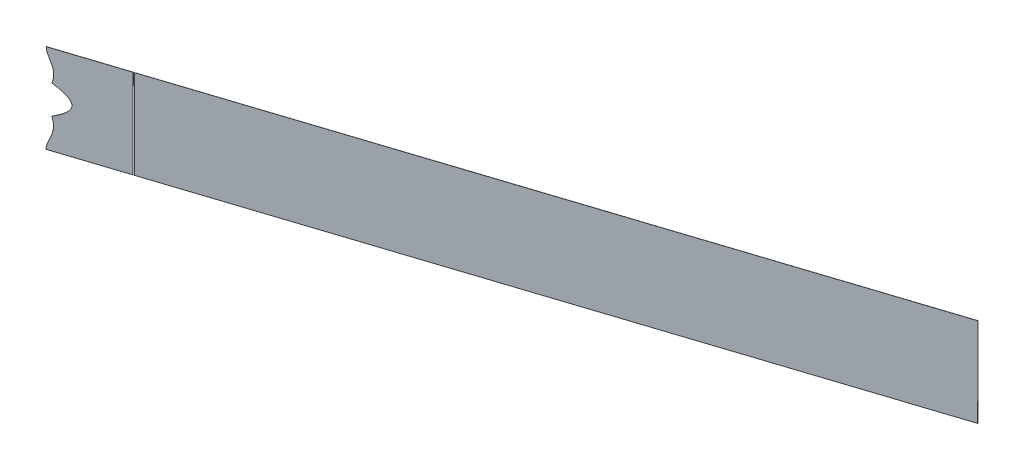
ISO-10303-21;
HEADER;
FILE_DESCRIPTION(('STEP AP214'),'2;1');
FILE_NAME('part.step','',(''),(''),'','','');
FILE_SCHEMA(('AUTOMOTIVE_DESIGN { 1 0 10303 214 1 1 1 1 }'));
ENDSEC;
DATA;
#1=APPLICATION_CONTEXT('core data for automotive mechanical design processes');
#2=APPLICATION_PROTOCOL_DEFINITION('international standard','automotive_design',2000,#1);
#3=PRODUCT_CONTEXT('',#1,'mechanical');
#4=PRODUCT('Part','Part','',(#3));
#5=PRODUCT_RELATED_PRODUCT_CATEGORY('part','',(#4));
#6=PRODUCT_DEFINITION_FORMATION('','',#4);
#7=PRODUCT_DEFINITION_CONTEXT('part definition',#1,'design');
#8=PRODUCT_DEFINITION('design','',#6,#7);
#9=PRODUCT_DEFINITION_SHAPE('','',#8);
#10=(LENGTH_UNIT() NAMED_UNIT(*) SI_UNIT(.MILLI.,.METRE.));
#11=(NAMED_UNIT(*) PLANE_ANGLE_UNIT() SI_UNIT($,.RADIAN.));
#12=(NAMED_UNIT(*) SI_UNIT($,.STERADIAN.) SOLID_ANGLE_UNIT());
#13=UNCERTAINTY_MEASURE_WITH_UNIT(LENGTH_MEASURE(1.E-05),#10,'distance_accuracy_value','');
#14=(GEOMETRIC_REPRESENTATION_CONTEXT(3) GLOBAL_UNCERTAINTY_ASSIGNED_CONTEXT((#13)) GLOBAL_UNIT_ASSIGNED_CONTEXT((#10,
#11,#12)) REPRESENTATION_CONTEXT('',''));
#15=CARTESIAN_POINT('',(0.,0.,0.));
#16=DIRECTION('',(0.,0.,1.));
#17=DIRECTION('',(1.,0.,0.));
#18=AXIS2_PLACEMENT_3D('',#15,#16,#17);
#19=CARTESIAN_POINT('',(7.6941798251794,-0.0503968253968697,-15.8534556793714));
#20=DIRECTION('',(0.00122625791418758,-0.999992126449225,0.00377403379482593));
#21=DIRECTION('',(0.,-0.00377403663235242,-0.999992878298389));
#22=AXIS2_PLACEMENT_3D('',#19,#20,#21);
#23=PLANE('',#22);
#24=DIRECTION('',(-0.309014561313953,-0.00396825396825808,-0.951049028103383));
#25=VECTOR('',#24,1.);
#26=CARTESIAN_POINT('',(69.5438428902936,-0.0107142857133384,-25.4350899596255));
#27=LINE('',#26,#25);
#28=CARTESIAN_POINT('',(66.4845987332853,-0.0499999999985215,-34.8504753378487));
#29=VERTEX_POINT('',#28);
#30=CARTESIAN_POINT('',(66.453697277154,-0.0503968253959192,-34.9455802406593));
#31=VERTEX_POINT('',#30);
#32=EDGE_CURVE('E130',#29,#31,#27,.T.);
#33=ORIENTED_EDGE('',*,*,#32,.T.);
#34=DIRECTION('',(0.951056516295153,0.,-0.309016994374949));
#35=VECTOR('',#34,1.);
#36=CARTESIAN_POINT('',(7.6941798251794,-0.0503968253968697,-15.8534556793714));
#37=LINE('',#36,#35);
#38=CARTESIAN_POINT('',(7.69417982517977,-0.0503968253958211,-15.8534556793713));
#39=VERTEX_POINT('',#38);
#40=EDGE_CURVE('E153',#39,#31,#37,.T.);
#41=ORIENTED_EDGE('',*,*,#40,.F.);
#42=DIRECTION('',(0.309014561313953,0.00396825396825806,0.951049028103383));
#43=VECTOR('',#42,1.);
#44=CARTESIAN_POINT('',(7.69417982517977,-0.0503968253958211,-15.8534556793713));
#45=LINE('',#44,#43);
#46=CARTESIAN_POINT('',(7.72508128131116,-0.0499999999989953,-15.758350776561));
#47=VERTEX_POINT('',#46);
#48=EDGE_CURVE('E140',#39,#47,#45,.T.);
#49=ORIENTED_EDGE('',*,*,#48,.T.);
#50=DIRECTION('',(0.951056516295153,0.,-0.309016994374949));
#51=VECTOR('',#50,1.);
#52=CARTESIAN_POINT('',(7.72508128131079,-0.0500000000000439,-15.758350776561));
#53=LINE('',#52,#51);
#54=EDGE_CURVE('E60',#47,#29,#53,.T.);
#55=ORIENTED_EDGE('',*,*,#54,.T.);
#56=EDGE_LOOP('',(#33,#41,#49,#55));
#57=FACE_BOUND('',#56,.T.);
#58=ADVANCED_FACE('F57',(#57),#23,.F.);
#59=CARTESIAN_POINT('',(7.79152250467645,-79.4316688549309,-15.5538657172189));
#60=DIRECTION('',(0.00122625791418755,-0.999992126449225,0.00377403379482594));
#61=DIRECTION('',(0.,-0.00377403663235243,-0.999992878298389));
#62=AXIS2_PLACEMENT_3D('',#59,#60,#61);
#63=PLANE('',#62);
#64=DIRECTION('',(0.951056516295153,0.,-0.309016994374949));
#65=VECTOR('',#64,1.);
#66=CARTESIAN_POINT('',(7.79152250467645,-79.4316688549309,-15.5538657172189));
#67=LINE('',#66,#65);
#68=CARTESIAN_POINT('',(7.79152250467594,-79.4316688549309,-15.5538657172187));
#69=VERTEX_POINT('',#68);
#70=CARTESIAN_POINT('',(67.5020964729461,-79.4316688549309,-34.9550072728817));
#71=VERTEX_POINT('',#70);
#72=EDGE_CURVE('E146',#69,#71,#67,.T.);
#73=ORIENTED_EDGE('',*,*,#72,.T.);
#74=DIRECTION('',(-0.309014561313953,-0.00396825396825808,-0.951049028103383));
#75=VECTOR('',#74,1.);
#76=CARTESIAN_POINT('',(70.5922420860856,-79.3919863152484,-25.4445169918479));
#77=LINE('',#76,#75);
#78=CARTESIAN_POINT('',(67.5329979290771,-79.4312720295352,-34.8599023700708));
#79=VERTEX_POINT('',#78);
#80=EDGE_CURVE('E66',#79,#71,#77,.T.);
#81=ORIENTED_EDGE('',*,*,#80,.F.);
#82=DIRECTION('',(0.951056516295153,0.,-0.309016994374949));
#83=VECTOR('',#82,1.);
#84=CARTESIAN_POINT('',(7.82242396080784,-79.4312720295341,-15.4587608144085));
#85=LINE('',#84,#83);
#86=CARTESIAN_POINT('',(7.82242396080733,-79.4312720295341,-15.4587608144084));
#87=VERTEX_POINT('',#86);
#88=EDGE_CURVE('E177',#87,#79,#85,.T.);
#89=ORIENTED_EDGE('',*,*,#88,.F.);
#90=DIRECTION('',(0.309014561313953,0.00396825396825806,0.951049028103383));
#91=VECTOR('',#90,1.);
#92=CARTESIAN_POINT('',(7.79152250467594,-79.4316688549309,-15.5538657172187));
#93=LINE('',#92,#91);
#94=EDGE_CURVE('E124',#69,#87,#93,.T.);
#95=ORIENTED_EDGE('',*,*,#94,.F.);
#96=EDGE_LOOP('',(#73,#81,#89,#95));
#97=FACE_BOUND('',#96,.T.);
#98=ADVANCED_FACE('F209',(#97),#63,.T.);
#99=CARTESIAN_POINT('',(-6335.94392116711,6657.43831861357,2017.54112415161));
#100=DIRECTION('',(-0.309014561313953,-0.00396825396825808,-0.951049028103383));
#101=DIRECTION('',(-0.951056516295153,0.,0.309016994374949));
#102=AXIS2_PLACEMENT_3D('',#99,#100,#101);
#103=PLANE('',#102);
#104=DIRECTION('',(-0.00122625791418582,0.999992126449225,-0.00377403379482654));
#105=VECTOR('',#104,1.);
#106=CARTESIAN_POINT('',(66.453697277154,-0.0503968253959192,-34.9455802406593));
#107=LINE('',#106,#105);
#108=CARTESIAN_POINT('',(66.5510383755583,-79.4303795012089,-34.6459951446096));
#109=VERTEX_POINT('',#108);
#110=EDGE_CURVE('E136',#109,#31,#107,.T.);
#111=ORIENTED_EDGE('',*,*,#110,.F.);
#112=DIRECTION('',(-0.951057306841153,0.00128935265031942,0.309011871412404));
#113=VECTOR('',#112,1.);
#114=CARTESIAN_POINT('',(66.5510383755583,-79.4303795012089,-34.6459951446096));
#115=LINE('',#114,#113);
#116=EDGE_CURVE('E14',#71,#109,#115,.T.);
#117=ORIENTED_EDGE('',*,*,#116,.F.);
#118=ORIENTED_EDGE('',*,*,#72,.F.);
#119=CARTESIAN_POINT('',(11.5973214751107,-52.6116321989723,-16.9023514191011));
#120=CARTESIAN_POINT('',(11.880021332476,-53.4693765115704,-16.9906272310246));
#121=CARTESIAN_POINT('',(12.3243048156577,-55.1299482507111,-17.1280549465251));
#122=CARTESIAN_POINT('',(12.6475799589412,-56.8227473349635,-17.2260302003221));
#123=CARTESIAN_POINT('',(12.8269288148534,-58.5339875185176,-17.277164023023));
#124=CARTESIAN_POINT('',(12.8492882312764,-60.2619705361145,-17.2772190252246));
#125=CARTESIAN_POINT('',(12.7109829764599,-61.9859245519917,-17.2250877222697));
#126=CARTESIAN_POINT('',(12.423970013855,-63.6895247155585,-17.1247232825621));
#127=CARTESIAN_POINT('',(12.0088982888613,-65.3631922901153,-16.9828749224666));
#128=CARTESIAN_POINT('',(11.4958537352224,-66.9973463961545,-16.8093581306745));
#129=CARTESIAN_POINT('',(11.1797349524949,-67.867247410739,-16.7030152480975));
#130=CARTESIAN_POINT('',(10.9220750444957,-68.5762803048092,-16.6163380278931));
#131=CARTESIAN_POINT('',(10.5678075102795,-69.4783752320334,-16.4974655354055));
#132=CARTESIAN_POINT('',(10.435233775274,-69.8159565294401,-16.4529811590621));
#133=CARTESIAN_POINT('',(10.0885816634332,-70.6848530724343,-16.336721587624));
#134=CARTESIAN_POINT('',(9.55384249698816,-72.0216046060618,-16.1573967016564));
#135=CARTESIAN_POINT('',(9.30159778580686,-72.6877992792752,-16.0726577281188));
#136=CARTESIAN_POINT('',(8.96361182755066,-73.5804421575115,-15.9591148790399));
#137=CARTESIAN_POINT('',(8.72405442673306,-74.3095605237517,-15.8782357132975));
#138=CARTESIAN_POINT('',(8.43313668982986,-75.1949995221584,-15.7800163146055));
#139=CARTESIAN_POINT('',(8.24021613139369,-75.9790331922441,-15.7140612433081));
#140=CARTESIAN_POINT('',(8.02346052320405,-76.8599330630482,-15.6399575204688));
#141=CARTESIAN_POINT('',(7.79381394927447,-78.5672427210742,-15.5582170724704));
#142=CARTESIAN_POINT('',(7.7915225046759,-79.4316688549322,-15.5538657172188));
#143=B_SPLINE_CURVE_WITH_KNOTS('',2,(#119,#120,#121,#122,#123,#124,#125,#126,#127,#128,#129,
#130,#131,#132,#133,#134,#135,#136,#137,#138,#139,#140,#141,#142),.UNSPECIFIED.,.F.,.F.,(3,1,1,
1,1,1,1,1,1,2,2,1,1,2,2,2,1,3),(0.,0.0625,0.125,0.1875,0.25,0.3125,0.375,0.4375,0.5,0.5625,
0.625,0.65625,0.6875,0.75,0.8125,0.875,0.9375,1.),.UNSPECIFIED.);
#144=CARTESIAN_POINT('',(11.5973216322441,-52.6116326757335,-16.9023514681676));
#145=VERTEX_POINT('',#144);
#146=EDGE_CURVE('E161',#145,#69,#143,.T.);
#147=ORIENTED_EDGE('',*,*,#146,.F.);
#148=CARTESIAN_POINT('',(11.5973214751107,-52.6116321989723,-16.9023514191011));
#149=CARTESIAN_POINT('',(13.823357893079,-51.4479684200354,-17.6304898852711));
#150=CARTESIAN_POINT('',(15.6982156234339,-50.3369915319264,-18.2443036427817));
#151=CARTESIAN_POINT('',(15.9063746580735,-50.2126749028105,-18.3124573244681));
#152=CARTESIAN_POINT('',(18.0805012906737,-48.9013379898872,-19.0243454453913));
#153=CARTESIAN_POINT('',(19.7272138162503,-47.6726723592705,-19.5645213887811));
#154=CARTESIAN_POINT('',(20.8454406273334,-46.8270584609381,-19.9313836302364));
#155=CARTESIAN_POINT('',(21.6762478592349,-46.0636665740444,-20.204514517826));
#156=CARTESIAN_POINT('',(22.6602060613233,-45.1595510588255,-20.5279943417463));
#157=CARTESIAN_POINT('',(23.3646889076603,-44.2755409513914,-20.7605832281176));
#158=CARTESIAN_POINT('',(24.2107173726805,-43.2139143722037,-21.0399041789971));
#159=CARTESIAN_POINT('',(24.663029587717,-42.1693456652739,-21.1912277915241));
#160=CARTESIAN_POINT('',(25.1953779153317,-40.939941758577,-21.3693279386775));
#161=CARTESIAN_POINT('',(25.182419340284,-38.5023625911408,-21.3752882463513));
#162=CARTESIAN_POINT('',(24.6420537314844,-37.2784652851526,-21.2048195308382));
#163=CARTESIAN_POINT('',(24.1819340320198,-36.2363203902184,-21.0596659295118));
#164=CARTESIAN_POINT('',(23.3299168693448,-35.177029154345,-20.787248666626));
#165=CARTESIAN_POINT('',(22.6229123550666,-34.298028450482,-20.5611966068033));
#166=CARTESIAN_POINT('',(21.6396013345,-33.3990451136564,-20.2454504984658));
#167=CARTESIAN_POINT('',(20.8075741619763,-32.6383716865924,-19.9782823937046));
#168=CARTESIAN_POINT('',(19.685110325139,-31.7924040198094,-19.6171015865857));
#169=CARTESIAN_POINT('',(18.0288437254508,-30.5615300324931,-19.0840837703031));
#170=CARTESIAN_POINT('',(15.8560097079869,-29.2546240284676,-18.383540269295));
#171=CARTESIAN_POINT('',(15.6537087525518,-29.1340776329297,-18.3183116843834));
#172=CARTESIAN_POINT('',(13.7835050062533,-28.0282806307363,-17.7152595914413));
#173=CARTESIAN_POINT('',(11.5657558779292,-26.8704334813566,-16.9995003378877));
#174=B_SPLINE_CURVE_WITH_KNOTS('',2,(#148,#149,#150,#151,#152,#153,#154,#155,#156,#157,#158,
#159,#160,#161,#162,#163,#164,#165,#166,#167,#168,#169,#170,#171,#172,#173),.UNSPECIFIED.,.F.,
.F.,(3,1,1,1,1,1,2,2,2,1,2,2,2,1,1,1,1,1,3),(0.,0.11875,0.125,0.13125,0.2440625,0.25,0.3125,
0.375,0.4375,0.5,0.5625,0.625,0.6875,0.75,0.75625,0.8690625,0.875,0.88125,1.),.UNSPECIFIED.);
#175=CARTESIAN_POINT('',(11.5657560339004,-26.870433004574,-16.9995003905552));
#176=VERTEX_POINT('',#175);
#177=EDGE_CURVE('E117',#145,#176,#174,.T.);
#178=ORIENTED_EDGE('',*,*,#177,.T.);
#179=CARTESIAN_POINT('',(7.69417982517977,-0.0503968253958211,-15.8534556793713));
#180=CARTESIAN_POINT('',(7.69854311683604,-0.905380477290335,-15.8513059777769));
#181=CARTESIAN_POINT('',(7.92847013452326,-2.60158233546576,-15.9189363888804));
#182=CARTESIAN_POINT('',(8.33946287656427,-4.26403874808862,-16.0455394230774));
#183=CARTESIAN_POINT('',(8.63104110127546,-5.14759564777318,-16.1365922883515));
#184=CARTESIAN_POINT('',(8.87281053984268,-5.88021913428111,-16.2120910679292));
#185=CARTESIAN_POINT('',(9.21403508960307,-6.77651982862343,-16.3192218285481));
#186=CARTESIAN_POINT('',(9.35453534292416,-7.14557438432745,-16.3633332473076));
#187=CARTESIAN_POINT('',(9.52813304948989,-7.5854750719871,-16.4179030748939));
#188=CARTESIAN_POINT('',(9.65946875767712,-7.91828285781399,-16.4591879921522));
#189=CARTESIAN_POINT('',(10.0079060540432,-8.78640774899193,-16.5687798798022));
#190=CARTESIAN_POINT('',(10.3281909622022,-9.58208906962483,-16.6695267729706));
#191=CARTESIAN_POINT('',(10.8468357620076,-10.8939022909829,-16.8325711404909));
#192=CARTESIAN_POINT('',(11.1071562906736,-11.6049864813912,-16.9141874073848));
#193=CARTESIAN_POINT('',(11.4219950678193,-12.4649911767654,-17.0128963559091));
#194=CARTESIAN_POINT('',(11.9360898296159,-14.0847347426079,-17.1731774864848));
#195=CARTESIAN_POINT('',(12.3568307233138,-15.7530921240839,-17.3029232653534));
#196=CARTESIAN_POINT('',(12.6513443977263,-17.4567314475243,-17.3915081205022));
#197=CARTESIAN_POINT('',(12.7976764389193,-19.1828630827805,-17.4318519951818));
#198=CARTESIAN_POINT('',(12.7827767163835,-20.9149364850705,-17.4197837021329));
#199=CARTESIAN_POINT('',(12.609349284114,-22.6369560435578,-17.3562485834761));
#200=CARTESIAN_POINT('',(12.2898505262247,-24.3374017957117,-17.2453420308206));
#201=CARTESIAN_POINT('',(11.8492878286753,-26.0037150078596,-17.0952418377573));
#202=CARTESIAN_POINT('',(11.5657558779292,-26.8704334813566,-16.9995003378877));
#203=B_SPLINE_CURVE_WITH_KNOTS('',2,(#179,#180,#181,#182,#183,#184,#185,#186,#187,#188,#189,
#190,#191,#192,#193,#194,#195,#196,#197,#198,#199,#200,#201,#202),.UNSPECIFIED.,.F.,.F.,(3,1,1,
2,2,2,1,1,1,2,1,1,1,1,1,1,1,1,3),(0.,0.0625,0.125,0.1875,0.25,0.28125,0.3125,0.34375,0.375,
0.4375,0.5,0.5625,0.625,0.6875,0.75,0.8125,0.875,0.9375,1.),.UNSPECIFIED.);
#204=EDGE_CURVE('E157',#39,#176,#203,.T.);
#205=ORIENTED_EDGE('',*,*,#204,.F.);
#206=ORIENTED_EDGE('',*,*,#40,.T.);
#207=EDGE_LOOP('',(#111,#117,#118,#147,#178,#205,#206));
#208=FACE_BOUND('',#207,.T.);
#209=ADVANCED_FACE('F207',(#208),#103,.T.);
#210=CARTESIAN_POINT('',(-6335.91301971098,6657.43871543897,2017.63622905442));
#211=DIRECTION('',(-0.309014561313953,-0.00396825396825808,-0.951049028103383));
#212=DIRECTION('',(-0.951056516295153,0.,0.309016994374949));
#213=AXIS2_PLACEMENT_3D('',#210,#211,#212);
#214=PLANE('',#213);
#215=DIRECTION('',(-0.951057306841152,0.00128935265031943,0.309011871412407));
#216=VECTOR('',#215,1.);
#217=CARTESIAN_POINT('',(-6335.91301971096,-70.7500915847463,2045.70961028262));
#218=LINE('',#217,#216);
#219=CARTESIAN_POINT('',(66.58193983169,-79.4299826758119,-34.5508902417986));
#220=VERTEX_POINT('',#219);
#221=EDGE_CURVE('E75',#79,#220,#218,.T.);
#222=ORIENTED_EDGE('',*,*,#221,.T.);
#223=DIRECTION('',(-0.00122625791418582,0.999992126449225,-0.00377403379482652));
#224=VECTOR('',#223,1.);
#225=CARTESIAN_POINT('',(58.3207362287901,6657.43871543895,-59.9762605677374));
#226=LINE('',#225,#224);
#227=EDGE_CURVE('E134',#220,#29,#226,.T.);
#228=ORIENTED_EDGE('',*,*,#227,.T.);
#229=ORIENTED_EDGE('',*,*,#54,.F.);
#230=CARTESIAN_POINT('',(7.72508128131116,-0.0499999999989953,-15.758350776561));
#231=CARTESIAN_POINT('',(7.72944457296743,-0.904983651893509,-15.7562010749666));
#232=CARTESIAN_POINT('',(7.95937159065465,-2.60118551006894,-15.82383148607));
#233=CARTESIAN_POINT('',(8.37036433269567,-4.2636419226918,-15.9504345202671));
#234=CARTESIAN_POINT('',(8.66194255740686,-5.14719882237635,-16.0414873855411));
#235=CARTESIAN_POINT('',(8.90371199597408,-5.87982230888429,-16.1169861651189));
#236=CARTESIAN_POINT('',(9.24493654573447,-6.77612300322661,-16.2241169257378));
#237=CARTESIAN_POINT('',(9.38543679905556,-7.14517755893063,-16.2682283444973));
#238=CARTESIAN_POINT('',(9.55903450562129,-7.58507824659027,-16.3227981720836));
#239=CARTESIAN_POINT('',(9.69037021380852,-7.91788603241717,-16.3640830893419));
#240=CARTESIAN_POINT('',(10.0388075101746,-8.7860109235951,-16.4736749769919));
#241=CARTESIAN_POINT('',(10.3590924183336,-9.581692244228,-16.5744218701603));
#242=CARTESIAN_POINT('',(10.877737218139,-10.8935054655861,-16.7374662376805));
#243=CARTESIAN_POINT('',(11.1380577468049,-11.6045896559944,-16.8190825045745));
#244=CARTESIAN_POINT('',(11.4528965239507,-12.4645943513686,-16.9177914530987));
#245=CARTESIAN_POINT('',(11.9669912857473,-14.0843379172111,-17.0780725836745));
#246=CARTESIAN_POINT('',(12.3877321794452,-15.7526952986871,-17.2078183625431));
#247=CARTESIAN_POINT('',(12.6822458538577,-17.4563346221275,-17.2964032176918));
#248=CARTESIAN_POINT('',(12.8285778950507,-19.1824662573836,-17.3367470923715));
#249=CARTESIAN_POINT('',(12.8136781725149,-20.9145396596737,-17.3246787993226));
#250=CARTESIAN_POINT('',(12.6402507402454,-22.636559218161,-17.2611436806658));
#251=CARTESIAN_POINT('',(12.3207519823561,-24.3370049703149,-17.1502371280103));
#252=CARTESIAN_POINT('',(11.8801892848067,-26.0033181824628,-17.000136934947));
#253=CARTESIAN_POINT('',(11.5966573340606,-26.8700366559598,-16.9043954350773));
#254=B_SPLINE_CURVE_WITH_KNOTS('',2,(#230,#231,#232,#233,#234,#235,#236,#237,#238,#239,#240,
#241,#242,#243,#244,#245,#246,#247,#248,#249,#250,#251,#252,#253),.UNSPECIFIED.,.F.,.F.,(3,1,1,
2,2,2,1,1,1,2,1,1,1,1,1,1,1,1,3),(0.,0.0625,0.125,0.1875,0.25,0.28125,0.3125,0.34375,0.375,
0.4375,0.5,0.5625,0.625,0.6875,0.75,0.8125,0.875,0.9375,1.),.UNSPECIFIED.);
#255=CARTESIAN_POINT('',(11.5966574900318,-26.8700361791772,-16.9043954877448));
#256=VERTEX_POINT('',#255);
#257=EDGE_CURVE('E149',#47,#256,#254,.T.);
#258=ORIENTED_EDGE('',*,*,#257,.T.);
#259=CARTESIAN_POINT('',(11.6282229312421,-52.6112353735755,-16.8072465162908));
#260=CARTESIAN_POINT('',(13.8542593492104,-51.4475715946386,-17.5353849824608));
#261=CARTESIAN_POINT('',(15.7291170795653,-50.3365947065296,-18.1491987399714));
#262=CARTESIAN_POINT('',(15.9372761142049,-50.2122780774136,-18.2173524216578));
#263=CARTESIAN_POINT('',(18.1114027468051,-48.9009411644904,-18.9292405425809));
#264=CARTESIAN_POINT('',(19.7581152723817,-47.6722755338737,-19.4694164859708));
#265=CARTESIAN_POINT('',(20.8763420834648,-46.8266616355413,-19.8362787274261));
#266=CARTESIAN_POINT('',(21.7071493153662,-46.0632697486476,-20.1094096150156));
#267=CARTESIAN_POINT('',(22.6911075174547,-45.1591542334286,-20.4328894389359));
#268=CARTESIAN_POINT('',(23.3955903637916,-44.2751441259945,-20.6654783253073));
#269=CARTESIAN_POINT('',(24.2416188288119,-43.2135175468069,-20.9447992761867));
#270=CARTESIAN_POINT('',(24.6939310438484,-42.1689488398771,-21.0961228887137));
#271=CARTESIAN_POINT('',(25.2262793714631,-40.9395449331802,-21.2742230358672));
#272=CARTESIAN_POINT('',(25.2133207964154,-38.5019657657439,-21.2801833435409));
#273=CARTESIAN_POINT('',(24.6729551876158,-37.2780684597558,-21.1097146280278));
#274=CARTESIAN_POINT('',(24.2128354881512,-36.2359235648215,-20.9645610267015));
#275=CARTESIAN_POINT('',(23.3608183254762,-35.1766323289482,-20.6921437638157));
#276=CARTESIAN_POINT('',(22.653813811198,-34.2976316250851,-20.466091703993));
#277=CARTESIAN_POINT('',(21.6705027906314,-33.3986482882596,-20.1503455956554));
#278=CARTESIAN_POINT('',(20.8384756181077,-32.6379748611956,-19.8831774908943));
#279=CARTESIAN_POINT('',(19.7160117812704,-31.7920071944126,-19.5219966837753));
#280=CARTESIAN_POINT('',(18.0597451815822,-30.5611332070963,-18.9889788674928));
#281=CARTESIAN_POINT('',(15.8869111641183,-29.2542272030708,-18.2884353664847));
#282=CARTESIAN_POINT('',(15.6846102086832,-29.1336808075328,-18.2232067815731));
#283=CARTESIAN_POINT('',(13.8144064623847,-28.0278838053395,-17.620154688631));
#284=CARTESIAN_POINT('',(11.5966573340606,-26.8700366559598,-16.9043954350773));
#285=B_SPLINE_CURVE_WITH_KNOTS('',2,(#259,#260,#261,#262,#263,#264,#265,#266,#267,#268,#269,
#270,#271,#272,#273,#274,#275,#276,#277,#278,#279,#280,#281,#282,#283,#284),.UNSPECIFIED.,.F.,
.F.,(3,1,1,1,1,1,2,2,2,1,2,2,2,1,1,1,1,1,3),(0.,0.11875,0.125,0.13125,0.2440625,0.25,0.3125,
0.375,0.4375,0.5,0.5625,0.625,0.6875,0.75,0.75625,0.8690625,0.875,0.88125,1.),.UNSPECIFIED.);
#286=CARTESIAN_POINT('',(11.6282230883755,-52.6112358503367,-16.8072465653573));
#287=VERTEX_POINT('',#286);
#288=EDGE_CURVE('E158',#287,#256,#285,.T.);
#289=ORIENTED_EDGE('',*,*,#288,.F.);
#290=CARTESIAN_POINT('',(11.6282229312421,-52.6112353735755,-16.8072465162908));
#291=CARTESIAN_POINT('',(11.9109227886074,-53.4689796861736,-16.8955223282143));
#292=CARTESIAN_POINT('',(12.3552062717891,-55.1295514253143,-17.0329500437147));
#293=CARTESIAN_POINT('',(12.6784814150726,-56.8223505095666,-17.1309252975118));
#294=CARTESIAN_POINT('',(12.8578302709848,-58.5335906931208,-17.1820591202126));
#295=CARTESIAN_POINT('',(12.8801896874078,-60.2615737107177,-17.1821141224143));
#296=CARTESIAN_POINT('',(12.7418844325913,-61.9855277265948,-17.1299828194593));
#297=CARTESIAN_POINT('',(12.4548714699864,-63.6891278901617,-17.0296183797518));
#298=CARTESIAN_POINT('',(12.0397997449927,-65.3627954647185,-16.8877700196563));
#299=CARTESIAN_POINT('',(11.5267551913538,-66.9969495707576,-16.7142532278641));
#300=CARTESIAN_POINT('',(11.2106364086263,-67.8668505853421,-16.6079103452872));
#301=CARTESIAN_POINT('',(10.9529765006271,-68.5758834794123,-16.5212331250828));
#302=CARTESIAN_POINT('',(10.5987089664109,-69.4779784066366,-16.4023606325952));
#303=CARTESIAN_POINT('',(10.4661352314054,-69.8155597040433,-16.3578762562518));
#304=CARTESIAN_POINT('',(10.1194831195646,-70.6844562470374,-16.2416166848136));
#305=CARTESIAN_POINT('',(9.58474395311956,-72.021207780665,-16.062291798846));
#306=CARTESIAN_POINT('',(9.33249924193826,-72.6874024538784,-15.9775528253085));
#307=CARTESIAN_POINT('',(8.99451328368205,-73.5800453321147,-15.8640099762296));
#308=CARTESIAN_POINT('',(8.75495588286446,-74.3091636983548,-15.7831308104872));
#309=CARTESIAN_POINT('',(8.46403814596125,-75.1946026967616,-15.6849114117951));
#310=CARTESIAN_POINT('',(8.27111758752508,-75.9786363668473,-15.6189563404977));
#311=CARTESIAN_POINT('',(8.05436197933545,-76.8595362376514,-15.5448526176585));
#312=CARTESIAN_POINT('',(7.82471540540587,-78.5668458956774,-15.46311216966));
#313=CARTESIAN_POINT('',(7.8224239608073,-79.4312720295354,-15.4587608144085));
#314=B_SPLINE_CURVE_WITH_KNOTS('',2,(#290,#291,#292,#293,#294,#295,#296,#297,#298,#299,#300,
#301,#302,#303,#304,#305,#306,#307,#308,#309,#310,#311,#312,#313),.UNSPECIFIED.,.F.,.F.,(3,1,1,
1,1,1,1,1,1,2,2,1,1,2,2,2,1,3),(0.,0.0625,0.125,0.1875,0.25,0.3125,0.375,0.4375,0.5,0.5625,
0.625,0.65625,0.6875,0.75,0.8125,0.875,0.9375,1.),.UNSPECIFIED.);
#315=EDGE_CURVE('E151',#287,#87,#314,.T.);
#316=ORIENTED_EDGE('',*,*,#315,.T.);
#317=ORIENTED_EDGE('',*,*,#88,.T.);
#318=EDGE_LOOP('',(#222,#228,#229,#258,#289,#316,#317));
#319=FACE_BOUND('',#318,.T.);
#320=ADVANCED_FACE('F147',(#319),#214,.F.);
#321=DIRECTION('',(0.309014561313953,0.00396825396825806,0.951049028103383));
#322=VECTOR('',#321,1.);
#323=SURFACE_OF_LINEAR_EXTRUSION('',#143,#322);
#324=ORIENTED_EDGE('',*,*,#315,.F.);
#325=DIRECTION('',(0.309014561313953,0.00396825396825806,0.951049028103383));
#326=VECTOR('',#325,1.);
#327=CARTESIAN_POINT('',(11.5973216322441,-52.6116326757335,-16.9023514681676));
#328=LINE('',#327,#326);
#329=EDGE_CURVE('E122',#145,#287,#328,.T.);
#330=ORIENTED_EDGE('',*,*,#329,.F.);
#331=ORIENTED_EDGE('',*,*,#146,.T.);
#332=ORIENTED_EDGE('',*,*,#94,.T.);
#333=EDGE_LOOP('',(#324,#330,#331,#332));
#334=FACE_BOUND('',#333,.T.);
#335=ADVANCED_FACE('F206',(#334),#323,.T.);
#336=DIRECTION('',(0.309014561313953,0.00396825396825806,0.951049028103383));
#337=VECTOR('',#336,1.);
#338=SURFACE_OF_LINEAR_EXTRUSION('',#174,#337);
#339=ORIENTED_EDGE('',*,*,#288,.T.);
#340=DIRECTION('',(0.309014561313953,0.00396825396825806,0.951049028103383));
#341=VECTOR('',#340,1.);
#342=CARTESIAN_POINT('',(11.5657560339004,-26.870433004574,-16.9995003905552));
#343=LINE('',#342,#341);
#344=EDGE_CURVE('E97',#176,#256,#343,.T.);
#345=ORIENTED_EDGE('',*,*,#344,.F.);
#346=ORIENTED_EDGE('',*,*,#177,.F.);
#347=ORIENTED_EDGE('',*,*,#329,.T.);
#348=EDGE_LOOP('',(#339,#345,#346,#347));
#349=FACE_BOUND('',#348,.T.);
#350=ADVANCED_FACE('F197',(#349),#338,.F.);
#351=DIRECTION('',(0.309014561313953,0.00396825396825806,0.951049028103383));
#352=VECTOR('',#351,1.);
#353=SURFACE_OF_LINEAR_EXTRUSION('',#203,#352);
#354=ORIENTED_EDGE('',*,*,#257,.F.);
#355=ORIENTED_EDGE('',*,*,#48,.F.);
#356=ORIENTED_EDGE('',*,*,#204,.T.);
#357=ORIENTED_EDGE('',*,*,#344,.T.);
#358=EDGE_LOOP('',(#354,#355,#356,#357));
#359=FACE_BOUND('',#358,.T.);
#360=ADVANCED_FACE('F193',(#359),#353,.T.);
#361=CARTESIAN_POINT('',(69.5438428902936,-0.0107142857133384,-25.4350899596255));
#362=DIRECTION('',(-0.951056516295153,0.,0.309016994374949));
#363=DIRECTION('',(0.309016994374949,0.,0.951056516295153));
#364=AXIS2_PLACEMENT_3D('',#361,#362,#363);
#365=PLANE('',#364);
#366=DIRECTION('',(-0.309014561313953,-0.00396825396825808,-0.951049028103383));
#367=VECTOR('',#366,1.);
#368=CARTESIAN_POINT('',(69.6411839886978,-79.3906969615263,-25.1355048635757));
#369=LINE('',#368,#367);
#370=EDGE_CURVE('E88',#220,#109,#369,.T.);
#371=ORIENTED_EDGE('',*,*,#370,.T.);
#372=ORIENTED_EDGE('',*,*,#110,.T.);
#373=ORIENTED_EDGE('',*,*,#32,.F.);
#374=ORIENTED_EDGE('',*,*,#227,.F.);
#375=EDGE_LOOP('',(#371,#372,#373,#374));
#376=FACE_BOUND('',#375,.T.);
#377=ADVANCED_FACE('F132',(#376),#365,.F.);
#378=CARTESIAN_POINT('',(69.6411839886978,-79.3906969615263,-25.1355048635757));
#379=DIRECTION('',(0.,-0.999991295227207,0.00417246567553069));
#380=DIRECTION('',(0.,-0.00417246567553069,-0.999991295227207));
#381=AXIS2_PLACEMENT_3D('',#378,#379,#380);
#382=PLANE('',#381);
#383=ORIENTED_EDGE('',*,*,#80,.T.);
#384=ORIENTED_EDGE('',*,*,#116,.T.);
#385=ORIENTED_EDGE('',*,*,#370,.F.);
#386=ORIENTED_EDGE('',*,*,#221,.F.);
#387=EDGE_LOOP('',(#383,#384,#385,#386));
#388=FACE_BOUND('',#387,.T.);
#389=ADVANCED_FACE('F201',(#388),#382,.F.);
#390=CLOSED_SHELL('',(#58,#98,#209,#320,#335,#350,#360,#377,#389));
#391=MANIFOLD_SOLID_BREP('B2',#390);
#392=CARTESIAN_POINT('',(637.184949733743,-79.431668854931,-220.056186903476));
#393=DIRECTION('',(0.951056516295153,0.,-0.309016994374948));
#394=DIRECTION('',(-0.309016994374948,0.,-0.951056516295153));
#395=AXIS2_PLACEMENT_3D('',#392,#393,#394);
#396=PLANE('',#395);
#397=DIRECTION('',(-0.00122625791418747,0.999992126449225,-0.00377403379482596));
#398=VECTOR('',#397,1.);
#399=CARTESIAN_POINT('',(637.215851189874,-79.4312720295341,-219.961082000666));
#400=LINE('',#399,#398);
#401=CARTESIAN_POINT('',(637.215851189874,-79.4312720295341,-219.961082000666));
#402=VERTEX_POINT('',#401);
#403=CARTESIAN_POINT('',(637.118508510377,-0.0500000000000366,-220.260671962818));
#404=VERTEX_POINT('',#403);
#405=EDGE_CURVE('E364',#402,#404,#400,.T.);
#406=ORIENTED_EDGE('',*,*,#405,.F.);
#407=DIRECTION('',(0.309014561313953,0.00396825396825806,0.951049028103383));
#408=VECTOR('',#407,1.);
#409=CARTESIAN_POINT('',(637.184949733743,-79.431668854931,-220.056186903476));
#410=LINE('',#409,#408);
#411=CARTESIAN_POINT('',(637.184949733743,-79.431668854931,-220.056186903476));
#412=VERTEX_POINT('',#411);
#413=EDGE_CURVE('E362',#412,#402,#410,.T.);
#414=ORIENTED_EDGE('',*,*,#413,.F.);
#415=DIRECTION('',(-0.00122625791418747,0.999992126449225,-0.00377403379482596));
#416=VECTOR('',#415,1.);
#417=CARTESIAN_POINT('',(637.184949733743,-79.431668854931,-220.056186903476));
#418=LINE('',#417,#416);
#419=CARTESIAN_POINT('',(637.087607054246,-0.0503968253968624,-220.355776865628));
#420=VERTEX_POINT('',#419);
#421=EDGE_CURVE('E357',#412,#420,#418,.T.);
#422=ORIENTED_EDGE('',*,*,#421,.T.);
#423=DIRECTION('',(0.309014561313953,0.00396825396825806,0.951049028103383));
#424=VECTOR('',#423,1.);
#425=CARTESIAN_POINT('',(637.087607054246,-0.0503968253968624,-220.355776865628));
#426=LINE('',#425,#424);
#427=EDGE_CURVE('E370',#420,#404,#426,.T.);
#428=ORIENTED_EDGE('',*,*,#427,.T.);
#429=EDGE_LOOP('',(#406,#414,#422,#428));
#430=FACE_BOUND('',#429,.T.);
#431=ADVANCED_FACE('F292',(#430),#396,.T.);
#432=CARTESIAN_POINT('',(-6335.91301971098,6657.43871543897,2017.63622905442));
#433=DIRECTION('',(-0.309014561313953,-0.00396825396825808,-0.951049028103383));
#434=DIRECTION('',(-0.951056516295153,0.,0.309016994374949));
#435=AXIS2_PLACEMENT_3D('',#432,#433,#434);
#436=PLANE('',#435);
#437=DIRECTION('',(0.951057306841152,-0.00128935265032201,-0.309011871412407));
#438=VECTOR('',#437,1.);
#439=CARTESIAN_POINT('',(-6335.91301971098,8.62975912532171,2045.37839769708));
#440=LINE('',#439,#438);
#441=CARTESIAN_POINT('',(66.4845987332853,-0.0499999999985215,-34.8504753378487));
#442=VERTEX_POINT('',#441);
#443=CARTESIAN_POINT('',(67.4356568306732,-0.0512893537205911,-35.1594874661207));
#444=VERTEX_POINT('',#443);
#445=EDGE_CURVE('E373',#442,#444,#440,.T.);
#446=ORIENTED_EDGE('',*,*,#445,.T.);
#447=DIRECTION('',(0.001226257914186,-0.999992126449225,0.00377403379482646));
#448=VECTOR('',#447,1.);
#449=CARTESIAN_POINT('',(59.2717927450828,6657.43871543895,-60.2852775621114));
#450=LINE('',#449,#448);
#451=CARTESIAN_POINT('',(67.5329979290771,-79.4312720295352,-34.8599023700708));
#452=VERTEX_POINT('',#451);
#453=EDGE_CURVE('E340',#444,#452,#450,.T.);
#454=ORIENTED_EDGE('',*,*,#453,.T.);
#455=DIRECTION('',(0.951056516295153,0.,-0.309016994374949));
#456=VECTOR('',#455,1.);
#457=CARTESIAN_POINT('',(7.82242396080784,-79.4312720295341,-15.4587608144085));
#458=LINE('',#457,#456);
#459=EDGE_CURVE('E358',#452,#402,#458,.T.);
#460=ORIENTED_EDGE('',*,*,#459,.T.);
#461=ORIENTED_EDGE('',*,*,#405,.T.);
#462=DIRECTION('',(0.951056516295153,0.,-0.309016994374949));
#463=VECTOR('',#462,1.);
#464=CARTESIAN_POINT('',(7.72508128131079,-0.0500000000000439,-15.758350776561));
#465=LINE('',#464,#463);
#466=EDGE_CURVE('E342',#442,#404,#465,.T.);
#467=ORIENTED_EDGE('',*,*,#466,.F.);
#468=EDGE_LOOP('',(#446,#454,#460,#461,#467));
#469=FACE_BOUND('',#468,.T.);
#470=ADVANCED_FACE('F376',(#469),#436,.F.);
#471=CARTESIAN_POINT('',(-6335.94392116711,6657.43831861357,2017.54112415161));
#472=DIRECTION('',(-0.309014561313953,-0.00396825396825808,-0.951049028103383));
#473=DIRECTION('',(-0.951056516295153,0.,0.309016994374949));
#474=AXIS2_PLACEMENT_3D('',#471,#472,#473);
#475=PLANE('',#474);
#476=DIRECTION('',(0.001226257914186,-0.999992126449225,0.00377403379482646));
#477=VECTOR('',#476,1.);
#478=CARTESIAN_POINT('',(67.4047553745418,-0.0516861791179888,-35.2545923689314));
#479=LINE('',#478,#477);
#480=CARTESIAN_POINT('',(67.4047553745418,-0.0516861791179888,-35.2545923689314));
#481=VERTEX_POINT('',#480);
#482=CARTESIAN_POINT('',(67.5020964729461,-79.4316688549309,-34.9550072728817));
#483=VERTEX_POINT('',#482);
#484=EDGE_CURVE('E338',#481,#483,#479,.T.);
#485=ORIENTED_EDGE('',*,*,#484,.F.);
#486=DIRECTION('',(0.951057306841154,-0.00128935265032199,-0.309011871412402));
#487=VECTOR('',#486,1.);
#488=CARTESIAN_POINT('',(66.453697277154,-0.0503968253959192,-34.9455802406593));
#489=LINE('',#488,#487);
#490=CARTESIAN_POINT('',(66.453697277154,-0.0503968253959192,-34.9455802406593));
#491=VERTEX_POINT('',#490);
#492=EDGE_CURVE('E345',#491,#481,#489,.T.);
#493=ORIENTED_EDGE('',*,*,#492,.F.);
#494=DIRECTION('',(0.951056516295153,0.,-0.309016994374949));
#495=VECTOR('',#494,1.);
#496=CARTESIAN_POINT('',(7.6941798251794,-0.0503968253968697,-15.8534556793714));
#497=LINE('',#496,#495);
#498=EDGE_CURVE('E355',#491,#420,#497,.T.);
#499=ORIENTED_EDGE('',*,*,#498,.T.);
#500=ORIENTED_EDGE('',*,*,#421,.F.);
#501=DIRECTION('',(0.951056516295153,0.,-0.309016994374949));
#502=VECTOR('',#501,1.);
#503=CARTESIAN_POINT('',(7.79152250467645,-79.4316688549309,-15.5538657172189));
#504=LINE('',#503,#502);
#505=EDGE_CURVE('E352',#483,#412,#504,.T.);
#506=ORIENTED_EDGE('',*,*,#505,.F.);
#507=EDGE_LOOP('',(#485,#493,#499,#500,#506));
#508=FACE_BOUND('',#507,.T.);
#509=ADVANCED_FACE('F350',(#508),#475,.T.);
#510=CARTESIAN_POINT('',(7.79152250467645,-79.4316688549309,-15.5538657172189));
#511=DIRECTION('',(0.00122625791418755,-0.999992126449225,0.00377403379482594));
#512=DIRECTION('',(0.,-0.00377403663235243,-0.999992878298389));
#513=AXIS2_PLACEMENT_3D('',#510,#511,#512);
#514=PLANE('',#513);
#515=DIRECTION('',(0.309014561313953,0.00396825396825806,0.951049028103383));
#516=VECTOR('',#515,1.);
#517=CARTESIAN_POINT('',(67.5020964729461,-79.4316688549309,-34.9550072728816));
#518=LINE('',#517,#516);
#519=EDGE_CURVE('E300',#483,#452,#518,.T.);
#520=ORIENTED_EDGE('',*,*,#519,.F.);
#521=ORIENTED_EDGE('',*,*,#505,.T.);
#522=ORIENTED_EDGE('',*,*,#413,.T.);
#523=ORIENTED_EDGE('',*,*,#459,.F.);
#524=EDGE_LOOP('',(#520,#521,#522,#523));
#525=FACE_BOUND('',#524,.T.);
#526=ADVANCED_FACE('F384',(#525),#514,.T.);
#527=CARTESIAN_POINT('',(7.6941798251794,-0.0503968253968697,-15.8534556793714));
#528=DIRECTION('',(0.00122625791418758,-0.999992126449225,0.00377403379482593));
#529=DIRECTION('',(0.,-0.00377403663235242,-0.999992878298389));
#530=AXIS2_PLACEMENT_3D('',#527,#528,#529);
#531=PLANE('',#530);
#532=ORIENTED_EDGE('',*,*,#498,.F.);
#533=DIRECTION('',(0.309014561313967,0.00396825396825807,0.951049028103378));
#534=VECTOR('',#533,1.);
#535=CARTESIAN_POINT('',(66.4536972778547,-0.0503968253968725,-34.9455802408878));
#536=LINE('',#535,#534);
#537=EDGE_CURVE('E55',#491,#442,#536,.T.);
#538=ORIENTED_EDGE('',*,*,#537,.T.);
#539=ORIENTED_EDGE('',*,*,#466,.T.);
#540=ORIENTED_EDGE('',*,*,#427,.F.);
#541=EDGE_LOOP('',(#532,#538,#539,#540));
#542=FACE_BOUND('',#541,.T.);
#543=ADVANCED_FACE('F294',(#542),#531,.F.);
#544=CARTESIAN_POINT('',(69.5438428902936,-0.0107142857133384,-25.4350899596255));
#545=DIRECTION('',(0.,0.999991295227207,-0.00417246567553149));
#546=DIRECTION('',(0.,0.00417246567553149,0.999991295227207));
#547=AXIS2_PLACEMENT_3D('',#544,#545,#546);
#548=PLANE('',#547);
#549=ORIENTED_EDGE('',*,*,#537,.F.);
#550=ORIENTED_EDGE('',*,*,#492,.T.);
#551=DIRECTION('',(-0.309014561313953,-0.00396825396825808,-0.951049028103383));
#552=VECTOR('',#551,1.);
#553=CARTESIAN_POINT('',(70.4949009876813,-0.012003639435408,-25.7441020878976));
#554=LINE('',#553,#552);
#555=EDGE_CURVE('E335',#444,#481,#554,.T.);
#556=ORIENTED_EDGE('',*,*,#555,.F.);
#557=ORIENTED_EDGE('',*,*,#445,.F.);
#558=EDGE_LOOP('',(#549,#550,#556,#557));
#559=FACE_BOUND('',#558,.T.);
#560=ADVANCED_FACE('F346',(#559),#548,.F.);
#561=CARTESIAN_POINT('',(70.4949009876813,-0.012003639435408,-25.7441020878976));
#562=DIRECTION('',(0.951056516295153,0.,-0.309016994374949));
#563=DIRECTION('',(-0.309016994374949,0.,-0.951056516295153));
#564=AXIS2_PLACEMENT_3D('',#561,#562,#563);
#565=PLANE('',#564);
#566=ORIENTED_EDGE('',*,*,#555,.T.);
#567=ORIENTED_EDGE('',*,*,#484,.T.);
#568=ORIENTED_EDGE('',*,*,#519,.T.);
#569=ORIENTED_EDGE('',*,*,#453,.F.);
#570=EDGE_LOOP('',(#566,#567,#568,#569));
#571=FACE_BOUND('',#570,.T.);
#572=ADVANCED_FACE('F336',(#571),#565,.F.);
#573=CLOSED_SHELL('',(#431,#470,#509,#526,#543,#560,#572));
#574=MANIFOLD_SOLID_BREP('B8',#573);
#575=ADVANCED_BREP_SHAPE_REPRESENTATION('',(#18,#391,#574),#14);
#576=SHAPE_DEFINITION_REPRESENTATION(#9,#575);
ENDSEC;
END-ISO-10303-21;
